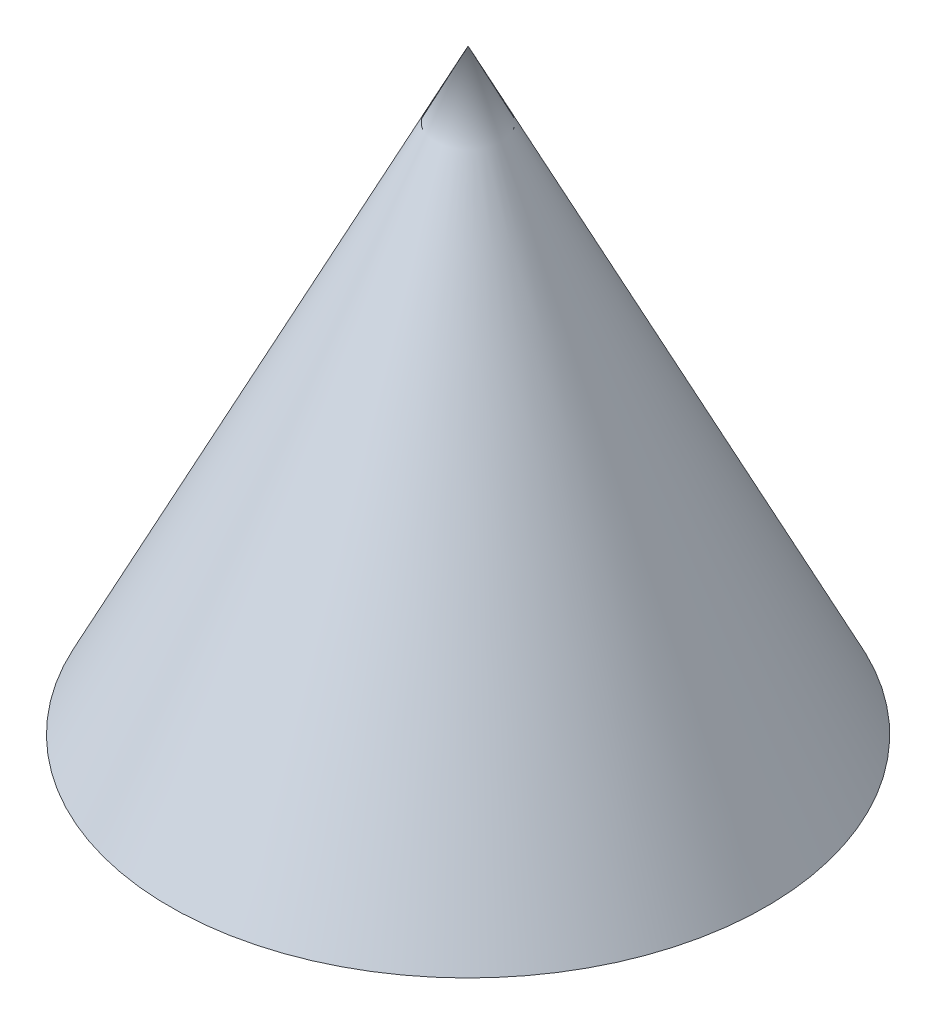
ISO-10303-21;
HEADER;
FILE_DESCRIPTION(('STEP AP214'),'2;1');
FILE_NAME('part.step','',(''),(''),'','','');
FILE_SCHEMA(('AUTOMOTIVE_DESIGN { 1 0 10303 214 1 1 1 1 }'));
ENDSEC;
DATA;
#1=APPLICATION_CONTEXT('core data for automotive mechanical design processes');
#2=APPLICATION_PROTOCOL_DEFINITION('international standard','automotive_design',2000,#1);
#3=PRODUCT_CONTEXT('',#1,'mechanical');
#4=PRODUCT('Part','Part','',(#3));
#5=PRODUCT_RELATED_PRODUCT_CATEGORY('part','',(#4));
#6=PRODUCT_DEFINITION_FORMATION('','',#4);
#7=PRODUCT_DEFINITION_CONTEXT('part definition',#1,'design');
#8=PRODUCT_DEFINITION('design','',#6,#7);
#9=PRODUCT_DEFINITION_SHAPE('','',#8);
#10=(LENGTH_UNIT() NAMED_UNIT(*) SI_UNIT(.MILLI.,.METRE.));
#11=(NAMED_UNIT(*) PLANE_ANGLE_UNIT() SI_UNIT($,.RADIAN.));
#12=(NAMED_UNIT(*) SI_UNIT($,.STERADIAN.) SOLID_ANGLE_UNIT());
#13=UNCERTAINTY_MEASURE_WITH_UNIT(LENGTH_MEASURE(1.E-05),#10,'distance_accuracy_value','');
#14=(GEOMETRIC_REPRESENTATION_CONTEXT(3) GLOBAL_UNCERTAINTY_ASSIGNED_CONTEXT((#13)) GLOBAL_UNIT_ASSIGNED_CONTEXT((#10,
#11,#12)) REPRESENTATION_CONTEXT('',''));
#15=CARTESIAN_POINT('',(0.,0.,0.));
#16=DIRECTION('',(0.,0.,1.));
#17=DIRECTION('',(1.,0.,0.));
#18=AXIS2_PLACEMENT_3D('',#15,#16,#17);
#19=CARTESIAN_POINT('',(0.,0.,0.));
#20=DIRECTION('',(0.,-1.,0.));
#21=DIRECTION('',(0.,0.,-1.));
#22=AXIS2_PLACEMENT_3D('',#19,#20,#21);
#23=PLANE('',#22);
#24=CARTESIAN_POINT('',(0.,0.,0.));
#25=DIRECTION('',(0.,-1.,0.));
#26=DIRECTION('',(0.,0.,-1.));
#27=AXIS2_PLACEMENT_3D('',#24,#25,#26);
#28=CIRCLE('',#27,25.);
#29=CARTESIAN_POINT('',(0.,0.,-25.));
#30=VERTEX_POINT('',#29);
#31=EDGE_CURVE('E11',#30,#30,#28,.T.);
#32=ORIENTED_EDGE('',*,*,#31,.T.);
#33=EDGE_LOOP('',(#32));
#34=FACE_BOUND('',#33,.T.);
#35=ADVANCED_FACE('F33',(#34),#23,.T.);
#36=CARTESIAN_POINT('',(0.,0.,0.));
#37=DIRECTION('',(0.,-1.,0.));
#38=DIRECTION('',(0.,0.,-1.));
#39=AXIS2_PLACEMENT_3D('',#36,#37,#38);
#40=CONICAL_SURFACE('',#39,25.,0.463647609000806);
#41=CARTESIAN_POINT('',(0.,50.,0.));
#42=VERTEX_POINT('',#41);
#43=VERTEX_LOOP('',#42);
#44=FACE_BOUND('',#43,.T.);
#45=ORIENTED_EDGE('',*,*,#31,.F.);
#46=EDGE_LOOP('',(#45));
#47=FACE_BOUND('',#46,.T.);
#48=ADVANCED_FACE('F40',(#44,#47),#40,.T.);
#49=CLOSED_SHELL('',(#35,#48));
#50=MANIFOLD_SOLID_BREP('B2',#49);
#51=ADVANCED_BREP_SHAPE_REPRESENTATION('',(#18,#50),#14);
#52=SHAPE_DEFINITION_REPRESENTATION(#9,#51);
ENDSEC;
END-ISO-10303-21;
